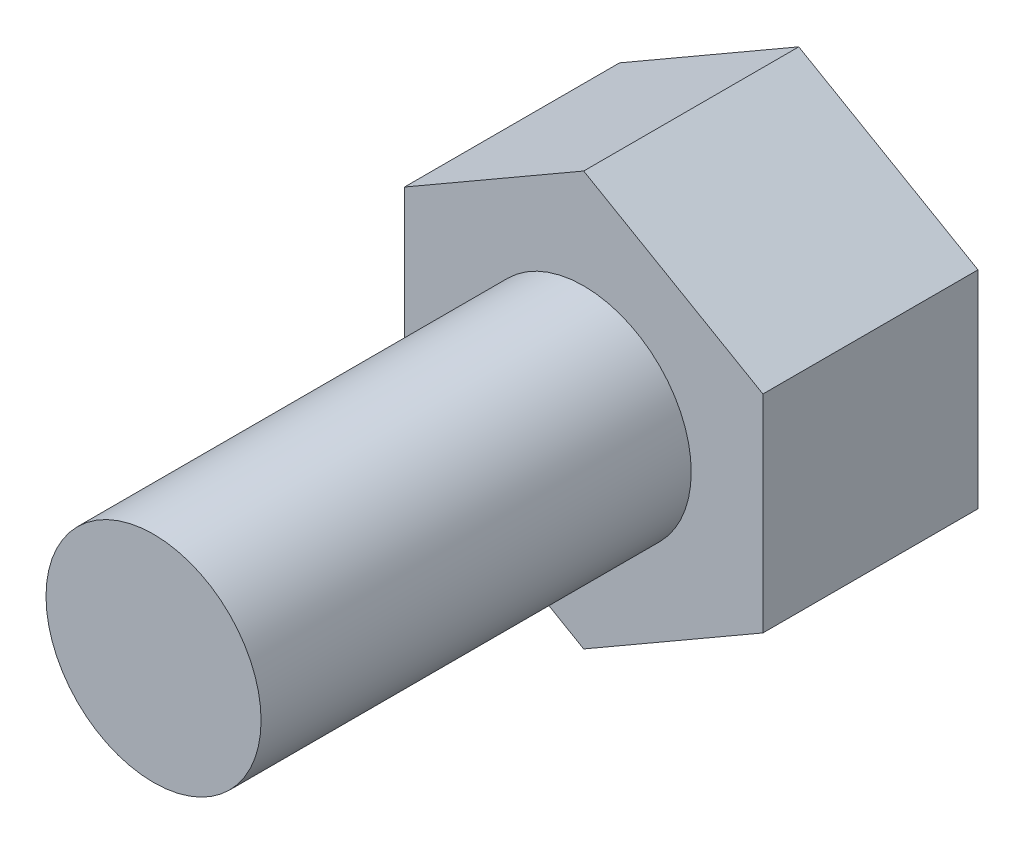
ISO-10303-21;
HEADER;
FILE_DESCRIPTION(('STEP AP214'),'2;1');
FILE_NAME('part.step','',(''),(''),'','','');
FILE_SCHEMA(('AUTOMOTIVE_DESIGN { 1 0 10303 214 1 1 1 1 }'));
ENDSEC;
DATA;
#1=APPLICATION_CONTEXT('core data for automotive mechanical design processes');
#2=APPLICATION_PROTOCOL_DEFINITION('international standard','automotive_design',2000,#1);
#3=PRODUCT_CONTEXT('',#1,'mechanical');
#4=PRODUCT('Part','Part','',(#3));
#5=PRODUCT_RELATED_PRODUCT_CATEGORY('part','',(#4));
#6=PRODUCT_DEFINITION_FORMATION('','',#4);
#7=PRODUCT_DEFINITION_CONTEXT('part definition',#1,'design');
#8=PRODUCT_DEFINITION('design','',#6,#7);
#9=PRODUCT_DEFINITION_SHAPE('','',#8);
#10=(LENGTH_UNIT() NAMED_UNIT(*) SI_UNIT(.MILLI.,.METRE.));
#11=(NAMED_UNIT(*) PLANE_ANGLE_UNIT() SI_UNIT($,.RADIAN.));
#12=(NAMED_UNIT(*) SI_UNIT($,.STERADIAN.) SOLID_ANGLE_UNIT());
#13=UNCERTAINTY_MEASURE_WITH_UNIT(LENGTH_MEASURE(1.E-05),#10,'distance_accuracy_value','');
#14=(GEOMETRIC_REPRESENTATION_CONTEXT(3) GLOBAL_UNCERTAINTY_ASSIGNED_CONTEXT((#13)) GLOBAL_UNIT_ASSIGNED_CONTEXT((#10,
#11,#12)) REPRESENTATION_CONTEXT('',''));
#15=CARTESIAN_POINT('',(0.,0.,0.));
#16=DIRECTION('',(0.,0.,1.));
#17=DIRECTION('',(1.,0.,0.));
#18=AXIS2_PLACEMENT_3D('',#15,#16,#17);
#19=CARTESIAN_POINT('',(-63.4947615904966,14.9787081339713,6.));
#20=DIRECTION('',(0.,0.,-1.));
#21=DIRECTION('',(-1.,0.,0.));
#22=AXIS2_PLACEMENT_3D('',#19,#20,#21);
#23=CYLINDRICAL_SURFACE('',#22,1.5);
#24=CARTESIAN_POINT('',(-63.4947615904966,14.9787081339713,6.));
#25=DIRECTION('',(0.,0.,1.));
#26=DIRECTION('',(1.,0.,0.));
#27=AXIS2_PLACEMENT_3D('',#24,#25,#26);
#28=CIRCLE('',#27,1.5);
#29=CARTESIAN_POINT('',(-61.9947615904966,14.9787081339713,6.));
#30=VERTEX_POINT('',#29);
#31=EDGE_CURVE('E11',#30,#30,#28,.T.);
#32=ORIENTED_EDGE('',*,*,#31,.F.);
#33=EDGE_LOOP('',(#32));
#34=FACE_BOUND('',#33,.T.);
#35=CARTESIAN_POINT('',(-63.4947615904966,14.9787081339713,0.));
#36=DIRECTION('',(0.,0.,-1.));
#37=DIRECTION('',(-1.,0.,0.));
#38=AXIS2_PLACEMENT_3D('',#35,#36,#37);
#39=CIRCLE('',#38,1.5);
#40=CARTESIAN_POINT('',(-64.9947615904966,14.9787081339713,0.));
#41=VERTEX_POINT('',#40);
#42=EDGE_CURVE('E41',#41,#41,#39,.T.);
#43=ORIENTED_EDGE('',*,*,#42,.F.);
#44=EDGE_LOOP('',(#43));
#45=FACE_BOUND('',#44,.T.);
#46=ADVANCED_FACE('F33',(#34,#45),#23,.T.);
#47=CARTESIAN_POINT('',(-63.4947615904966,14.9787081339713,6.));
#48=DIRECTION('',(0.,0.,1.));
#49=DIRECTION('',(1.,0.,0.));
#50=AXIS2_PLACEMENT_3D('',#47,#48,#49);
#51=PLANE('',#50);
#52=ORIENTED_EDGE('',*,*,#31,.T.);
#53=EDGE_LOOP('',(#52));
#54=FACE_BOUND('',#53,.T.);
#55=ADVANCED_FACE('F143',(#54),#51,.T.);
#56=CARTESIAN_POINT('',(-60.9947615904966,13.5353324609972,-3.));
#57=DIRECTION('',(-0.5,0.866025403784439,0.));
#58=DIRECTION('',(-0.866025403784439,-0.5,0.));
#59=AXIS2_PLACEMENT_3D('',#56,#57,#58);
#60=PLANE('',#59);
#61=DIRECTION('',(-0.866025403784439,-0.5,0.));
#62=VECTOR('',#61,1.);
#63=CARTESIAN_POINT('',(-60.9947615904966,13.5353324609972,0.));
#64=LINE('',#63,#62);
#65=CARTESIAN_POINT('',(-60.9947615904966,13.5353324609972,0.));
#66=VERTEX_POINT('',#65);
#67=CARTESIAN_POINT('',(-63.4947615904967,12.0919567880232,0.));
#68=VERTEX_POINT('',#67);
#69=EDGE_CURVE('E118',#66,#68,#64,.T.);
#70=ORIENTED_EDGE('',*,*,#69,.T.);
#71=DIRECTION('',(0.,0.,1.));
#72=VECTOR('',#71,1.);
#73=CARTESIAN_POINT('',(-63.4947615904967,12.0919567880232,-3.));
#74=LINE('',#73,#72);
#75=CARTESIAN_POINT('',(-63.4947615904967,12.0919567880232,-3.));
#76=VERTEX_POINT('',#75);
#77=EDGE_CURVE('E135',#76,#68,#74,.T.);
#78=ORIENTED_EDGE('',*,*,#77,.F.);
#79=DIRECTION('',(-0.866025403784439,-0.5,0.));
#80=VECTOR('',#79,1.);
#81=CARTESIAN_POINT('',(-60.9947615904966,13.5353324609972,-3.));
#82=LINE('',#81,#80);
#83=CARTESIAN_POINT('',(-60.9947615904966,13.5353324609972,-3.));
#84=VERTEX_POINT('',#83);
#85=EDGE_CURVE('E128',#84,#76,#82,.T.);
#86=ORIENTED_EDGE('',*,*,#85,.F.);
#87=DIRECTION('',(0.,0.,1.));
#88=VECTOR('',#87,1.);
#89=CARTESIAN_POINT('',(-60.9947615904966,13.5353324609972,-3.));
#90=LINE('',#89,#88);
#91=EDGE_CURVE('E114',#84,#66,#90,.T.);
#92=ORIENTED_EDGE('',*,*,#91,.T.);
#93=EDGE_LOOP('',(#70,#78,#86,#92));
#94=FACE_BOUND('',#93,.T.);
#95=ADVANCED_FACE('F148',(#94),#60,.F.);
#96=CARTESIAN_POINT('',(-63.4947615904967,12.0919567880232,-3.));
#97=DIRECTION('',(0.5,0.866025403784438,0.));
#98=DIRECTION('',(-0.866025403784438,0.5,0.));
#99=AXIS2_PLACEMENT_3D('',#96,#97,#98);
#100=PLANE('',#99);
#101=DIRECTION('',(-0.866025403784438,0.5,0.));
#102=VECTOR('',#101,1.);
#103=CARTESIAN_POINT('',(-63.4947615904967,12.0919567880232,0.));
#104=LINE('',#103,#102);
#105=CARTESIAN_POINT('',(-65.9947615904966,13.5353324609972,0.));
#106=VERTEX_POINT('',#105);
#107=EDGE_CURVE('E121',#68,#106,#104,.T.);
#108=ORIENTED_EDGE('',*,*,#107,.T.);
#109=DIRECTION('',(0.,0.,1.));
#110=VECTOR('',#109,1.);
#111=CARTESIAN_POINT('',(-65.9947615904966,13.5353324609972,-3.));
#112=LINE('',#111,#110);
#113=CARTESIAN_POINT('',(-65.9947615904966,13.5353324609972,-3.));
#114=VERTEX_POINT('',#113);
#115=EDGE_CURVE('E132',#114,#106,#112,.T.);
#116=ORIENTED_EDGE('',*,*,#115,.F.);
#117=DIRECTION('',(-0.866025403784438,0.5,0.));
#118=VECTOR('',#117,1.);
#119=CARTESIAN_POINT('',(-63.4947615904967,12.0919567880232,-3.));
#120=LINE('',#119,#118);
#121=EDGE_CURVE('E87',#76,#114,#120,.T.);
#122=ORIENTED_EDGE('',*,*,#121,.F.);
#123=ORIENTED_EDGE('',*,*,#77,.T.);
#124=EDGE_LOOP('',(#108,#116,#122,#123));
#125=FACE_BOUND('',#124,.T.);
#126=ADVANCED_FACE('F154',(#125),#100,.F.);
#127=CARTESIAN_POINT('',(-65.9947615904966,13.5353324609972,-3.));
#128=DIRECTION('',(1.,0.,0.));
#129=DIRECTION('',(0.,0.,-1.));
#130=AXIS2_PLACEMENT_3D('',#127,#128,#129);
#131=PLANE('',#130);
#132=DIRECTION('',(0.,1.,0.));
#133=VECTOR('',#132,1.);
#134=CARTESIAN_POINT('',(-65.9947615904966,13.5353324609972,0.));
#135=LINE('',#134,#133);
#136=CARTESIAN_POINT('',(-65.9947615904966,16.4220838069454,0.));
#137=VERTEX_POINT('',#136);
#138=EDGE_CURVE('E123',#106,#137,#135,.T.);
#139=ORIENTED_EDGE('',*,*,#138,.T.);
#140=DIRECTION('',(0.,0.,1.));
#141=VECTOR('',#140,1.);
#142=CARTESIAN_POINT('',(-65.9947615904966,16.4220838069454,-3.));
#143=LINE('',#142,#141);
#144=CARTESIAN_POINT('',(-65.9947615904966,16.4220838069454,-3.));
#145=VERTEX_POINT('',#144);
#146=EDGE_CURVE('E109',#145,#137,#143,.T.);
#147=ORIENTED_EDGE('',*,*,#146,.F.);
#148=DIRECTION('',(0.,1.,0.));
#149=VECTOR('',#148,1.);
#150=CARTESIAN_POINT('',(-65.9947615904966,13.5353324609972,-3.));
#151=LINE('',#150,#149);
#152=EDGE_CURVE('E100',#114,#145,#151,.T.);
#153=ORIENTED_EDGE('',*,*,#152,.F.);
#154=ORIENTED_EDGE('',*,*,#115,.T.);
#155=EDGE_LOOP('',(#139,#147,#153,#154));
#156=FACE_BOUND('',#155,.T.);
#157=ADVANCED_FACE('F160',(#156),#131,.F.);
#158=CARTESIAN_POINT('',(-65.9947615904966,16.4220838069454,-3.));
#159=DIRECTION('',(0.499999999999999,-0.866025403784439,0.));
#160=DIRECTION('',(0.866025403784439,0.499999999999999,0.));
#161=AXIS2_PLACEMENT_3D('',#158,#159,#160);
#162=PLANE('',#161);
#163=DIRECTION('',(0.866025403784439,0.499999999999999,0.));
#164=VECTOR('',#163,1.);
#165=CARTESIAN_POINT('',(-65.9947615904966,16.4220838069454,0.));
#166=LINE('',#165,#164);
#167=CARTESIAN_POINT('',(-63.4947615904966,17.8654594799194,0.));
#168=VERTEX_POINT('',#167);
#169=EDGE_CURVE('E108',#137,#168,#166,.T.);
#170=ORIENTED_EDGE('',*,*,#169,.T.);
#171=DIRECTION('',(0.,0.,1.));
#172=VECTOR('',#171,1.);
#173=CARTESIAN_POINT('',(-63.4947615904966,17.8654594799194,-3.));
#174=LINE('',#173,#172);
#175=CARTESIAN_POINT('',(-63.4947615904966,17.8654594799194,-3.));
#176=VERTEX_POINT('',#175);
#177=EDGE_CURVE('E105',#176,#168,#174,.T.);
#178=ORIENTED_EDGE('',*,*,#177,.F.);
#179=DIRECTION('',(0.866025403784439,0.499999999999999,0.));
#180=VECTOR('',#179,1.);
#181=CARTESIAN_POINT('',(-65.9947615904966,16.4220838069454,-3.));
#182=LINE('',#181,#180);
#183=EDGE_CURVE('E94',#145,#176,#182,.T.);
#184=ORIENTED_EDGE('',*,*,#183,.F.);
#185=ORIENTED_EDGE('',*,*,#146,.T.);
#186=EDGE_LOOP('',(#170,#178,#184,#185));
#187=FACE_BOUND('',#186,.T.);
#188=ADVANCED_FACE('F106',(#187),#162,.F.);
#189=CARTESIAN_POINT('',(-63.4947615904966,17.8654594799194,-3.));
#190=DIRECTION('',(-0.500000000000001,-0.866025403784438,0.));
#191=DIRECTION('',(0.866025403784438,-0.500000000000001,0.));
#192=AXIS2_PLACEMENT_3D('',#189,#190,#191);
#193=PLANE('',#192);
#194=DIRECTION('',(0.866025403784438,-0.500000000000001,0.));
#195=VECTOR('',#194,1.);
#196=CARTESIAN_POINT('',(-63.4947615904966,17.8654594799194,0.));
#197=LINE('',#196,#195);
#198=CARTESIAN_POINT('',(-60.9947615904966,16.4220838069454,0.));
#199=VERTEX_POINT('',#198);
#200=EDGE_CURVE('E72',#168,#199,#197,.T.);
#201=ORIENTED_EDGE('',*,*,#200,.T.);
#202=DIRECTION('',(0.,0.,1.));
#203=VECTOR('',#202,1.);
#204=CARTESIAN_POINT('',(-60.9947615904966,16.4220838069454,-3.));
#205=LINE('',#204,#203);
#206=CARTESIAN_POINT('',(-60.9947615904966,16.4220838069454,-3.));
#207=VERTEX_POINT('',#206);
#208=EDGE_CURVE('E110',#207,#199,#205,.T.);
#209=ORIENTED_EDGE('',*,*,#208,.F.);
#210=DIRECTION('',(0.866025403784438,-0.500000000000001,0.));
#211=VECTOR('',#210,1.);
#212=CARTESIAN_POINT('',(-63.4947615904966,17.8654594799194,-3.));
#213=LINE('',#212,#211);
#214=EDGE_CURVE('E98',#176,#207,#213,.T.);
#215=ORIENTED_EDGE('',*,*,#214,.F.);
#216=ORIENTED_EDGE('',*,*,#177,.T.);
#217=EDGE_LOOP('',(#201,#209,#215,#216));
#218=FACE_BOUND('',#217,.T.);
#219=ADVANCED_FACE('F112',(#218),#193,.F.);
#220=CARTESIAN_POINT('',(-60.9947615904966,16.4220838069454,-3.));
#221=DIRECTION('',(-1.,0.,0.));
#222=DIRECTION('',(0.,0.,1.));
#223=AXIS2_PLACEMENT_3D('',#220,#221,#222);
#224=PLANE('',#223);
#225=DIRECTION('',(0.,-1.,0.));
#226=VECTOR('',#225,1.);
#227=CARTESIAN_POINT('',(-60.9947615904966,16.4220838069454,0.));
#228=LINE('',#227,#226);
#229=EDGE_CURVE('E78',#199,#66,#228,.T.);
#230=ORIENTED_EDGE('',*,*,#229,.T.);
#231=ORIENTED_EDGE('',*,*,#91,.F.);
#232=DIRECTION('',(0.,-1.,0.));
#233=VECTOR('',#232,1.);
#234=CARTESIAN_POINT('',(-60.9947615904966,16.4220838069454,-3.));
#235=LINE('',#234,#233);
#236=EDGE_CURVE('E49',#207,#84,#235,.T.);
#237=ORIENTED_EDGE('',*,*,#236,.F.);
#238=ORIENTED_EDGE('',*,*,#208,.T.);
#239=EDGE_LOOP('',(#230,#231,#237,#238));
#240=FACE_BOUND('',#239,.T.);
#241=ADVANCED_FACE('F168',(#240),#224,.F.);
#242=CARTESIAN_POINT('',(0.,0.,-3.));
#243=DIRECTION('',(0.,0.,-1.));
#244=DIRECTION('',(-1.,0.,0.));
#245=AXIS2_PLACEMENT_3D('',#242,#243,#244);
#246=PLANE('',#245);
#247=ORIENTED_EDGE('',*,*,#85,.T.);
#248=ORIENTED_EDGE('',*,*,#121,.T.);
#249=ORIENTED_EDGE('',*,*,#152,.T.);
#250=ORIENTED_EDGE('',*,*,#183,.T.);
#251=ORIENTED_EDGE('',*,*,#214,.T.);
#252=ORIENTED_EDGE('',*,*,#236,.T.);
#253=EDGE_LOOP('',(#247,#248,#249,#250,#251,#252));
#254=FACE_BOUND('',#253,.T.);
#255=ADVANCED_FACE('F96',(#254),#246,.T.);
#256=CARTESIAN_POINT('',(0.,0.,0.));
#257=DIRECTION('',(0.,0.,-1.));
#258=DIRECTION('',(-1.,0.,0.));
#259=AXIS2_PLACEMENT_3D('',#256,#257,#258);
#260=PLANE('',#259);
#261=ORIENTED_EDGE('',*,*,#42,.T.);
#262=EDGE_LOOP('',(#261));
#263=FACE_BOUND('',#262,.T.);
#264=ORIENTED_EDGE('',*,*,#69,.F.);
#265=ORIENTED_EDGE('',*,*,#229,.F.);
#266=ORIENTED_EDGE('',*,*,#200,.F.);
#267=ORIENTED_EDGE('',*,*,#169,.F.);
#268=ORIENTED_EDGE('',*,*,#138,.F.);
#269=ORIENTED_EDGE('',*,*,#107,.F.);
#270=EDGE_LOOP('',(#264,#265,#266,#267,#268,#269));
#271=FACE_BOUND('',#270,.T.);
#272=ADVANCED_FACE('F139',(#263,#271),#260,.F.);
#273=CLOSED_SHELL('',(#46,#55,#95,#126,#157,#188,#219,#241,#255,#272));
#274=MANIFOLD_SOLID_BREP('B2',#273);
#275=ADVANCED_BREP_SHAPE_REPRESENTATION('',(#18,#274),#14);
#276=SHAPE_DEFINITION_REPRESENTATION(#9,#275);
ENDSEC;
END-ISO-10303-21;
